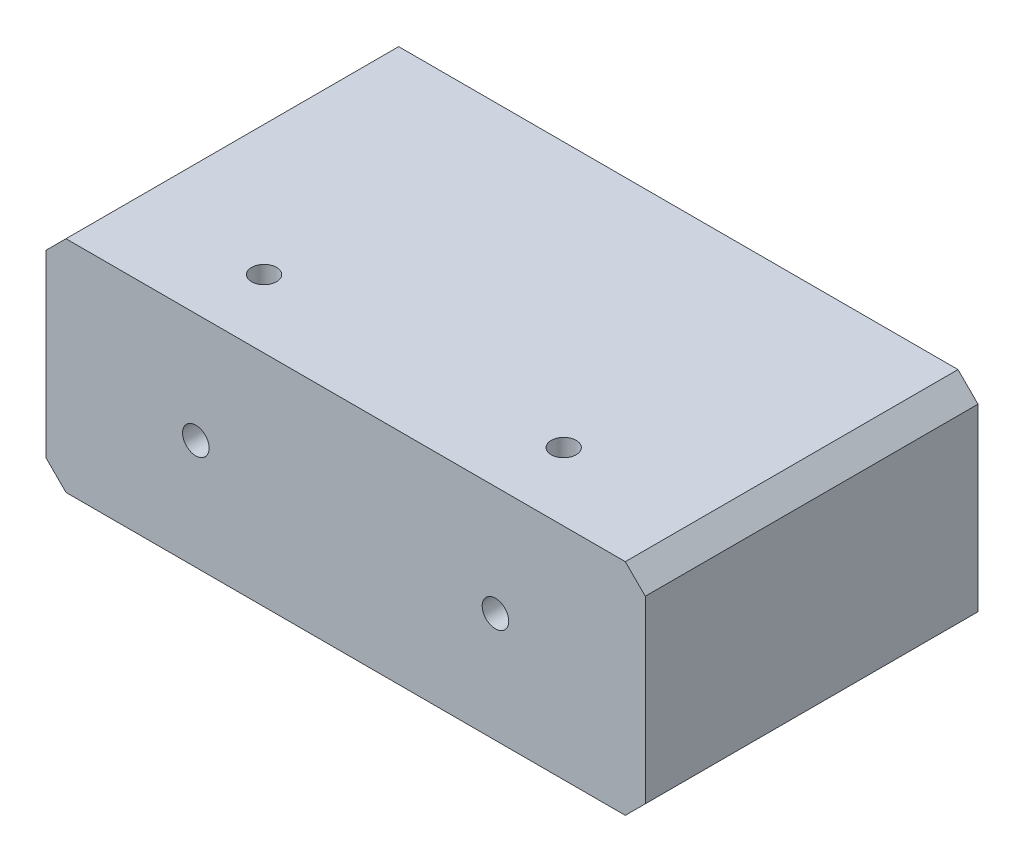
ISO-10303-21;
HEADER;
FILE_DESCRIPTION(('STEP AP214'),'2;1');
FILE_NAME('part.step','',(''),(''),'','','');
FILE_SCHEMA(('AUTOMOTIVE_DESIGN { 1 0 10303 214 1 1 1 1 }'));
ENDSEC;
DATA;
#1=APPLICATION_CONTEXT('core data for automotive mechanical design processes');
#2=APPLICATION_PROTOCOL_DEFINITION('international standard','automotive_design',2000,#1);
#3=PRODUCT_CONTEXT('',#1,'mechanical');
#4=PRODUCT('Part','Part','',(#3));
#5=PRODUCT_RELATED_PRODUCT_CATEGORY('part','',(#4));
#6=PRODUCT_DEFINITION_FORMATION('','',#4);
#7=PRODUCT_DEFINITION_CONTEXT('part definition',#1,'design');
#8=PRODUCT_DEFINITION('design','',#6,#7);
#9=PRODUCT_DEFINITION_SHAPE('','',#8);
#10=(LENGTH_UNIT() NAMED_UNIT(*) SI_UNIT(.MILLI.,.METRE.));
#11=(NAMED_UNIT(*) PLANE_ANGLE_UNIT() SI_UNIT($,.RADIAN.));
#12=(NAMED_UNIT(*) SI_UNIT($,.STERADIAN.) SOLID_ANGLE_UNIT());
#13=UNCERTAINTY_MEASURE_WITH_UNIT(LENGTH_MEASURE(1.E-05),#10,'distance_accuracy_value','');
#14=(GEOMETRIC_REPRESENTATION_CONTEXT(3) GLOBAL_UNCERTAINTY_ASSIGNED_CONTEXT((#13)) GLOBAL_UNIT_ASSIGNED_CONTEXT((#10,
#11,#12)) REPRESENTATION_CONTEXT('',''));
#15=CARTESIAN_POINT('',(0.,0.,0.));
#16=DIRECTION('',(0.,0.,1.));
#17=DIRECTION('',(1.,0.,0.));
#18=AXIS2_PLACEMENT_3D('',#15,#16,#17);
#19=CARTESIAN_POINT('',(-76.2,55.88,42.3037));
#20=DIRECTION('',(1.,0.,0.));
#21=DIRECTION('',(0.,0.,-1.));
#22=AXIS2_PLACEMENT_3D('',#19,#20,#21);
#23=PLANE('',#22);
#24=DIRECTION('',(0.,-1.,0.));
#25=VECTOR('',#24,1.);
#26=CARTESIAN_POINT('',(-76.2,55.88,-42.3037));
#27=LINE('',#26,#25);
#28=CARTESIAN_POINT('',(-76.2,50.8,-42.3037));
#29=VERTEX_POINT('',#28);
#30=CARTESIAN_POINT('',(-76.2,5.08000000000003,-42.3037));
#31=VERTEX_POINT('',#30);
#32=EDGE_CURVE('E177',#29,#31,#27,.T.);
#33=ORIENTED_EDGE('',*,*,#32,.T.);
#34=DIRECTION('',(0.,0.,1.));
#35=VECTOR('',#34,1.);
#36=CARTESIAN_POINT('',(-76.2,5.08,42.3037));
#37=LINE('',#36,#35);
#38=CARTESIAN_POINT('',(-76.2,5.08000000000002,42.3037));
#39=VERTEX_POINT('',#38);
#40=EDGE_CURVE('E13',#31,#39,#37,.T.);
#41=ORIENTED_EDGE('',*,*,#40,.T.);
#42=DIRECTION('',(0.,-1.,0.));
#43=VECTOR('',#42,1.);
#44=CARTESIAN_POINT('',(-76.2,55.88,42.3037));
#45=LINE('',#44,#43);
#46=CARTESIAN_POINT('',(-76.2,50.8,42.3037));
#47=VERTEX_POINT('',#46);
#48=EDGE_CURVE('E191',#47,#39,#45,.T.);
#49=ORIENTED_EDGE('',*,*,#48,.F.);
#50=DIRECTION('',(0.,0.,-1.));
#51=VECTOR('',#50,1.);
#52=CARTESIAN_POINT('',(-76.2,50.8,-42.3037));
#53=LINE('',#52,#51);
#54=EDGE_CURVE('E62',#47,#29,#53,.T.);
#55=ORIENTED_EDGE('',*,*,#54,.T.);
#56=EDGE_LOOP('',(#33,#41,#49,#55));
#57=FACE_BOUND('',#56,.T.);
#58=ADVANCED_FACE('F53',(#57),#23,.F.);
#59=CARTESIAN_POINT('',(76.2,55.88,42.3037));
#60=DIRECTION('',(0.,0.,-1.));
#61=DIRECTION('',(-1.,0.,0.));
#62=AXIS2_PLACEMENT_3D('',#59,#60,#61);
#63=PLANE('',#62);
#64=CARTESIAN_POINT('',(-38.1,27.94,42.3037));
#65=DIRECTION('',(0.,0.,1.));
#66=DIRECTION('',(1.,0.,0.));
#67=AXIS2_PLACEMENT_3D('',#64,#65,#66);
#68=CIRCLE('',#67,3.3782);
#69=CARTESIAN_POINT('',(-34.7218,27.94,42.3037));
#70=VERTEX_POINT('',#69);
#71=EDGE_CURVE('E228',#70,#70,#68,.T.);
#72=ORIENTED_EDGE('',*,*,#71,.F.);
#73=EDGE_LOOP('',(#72));
#74=FACE_BOUND('',#73,.T.);
#75=CARTESIAN_POINT('',(38.1,27.94,42.3037));
#76=DIRECTION('',(0.,0.,1.));
#77=DIRECTION('',(1.,0.,0.));
#78=AXIS2_PLACEMENT_3D('',#75,#76,#77);
#79=CIRCLE('',#78,3.3782);
#80=CARTESIAN_POINT('',(41.4782,27.94,42.3037));
#81=VERTEX_POINT('',#80);
#82=EDGE_CURVE('E159',#81,#81,#79,.T.);
#83=ORIENTED_EDGE('',*,*,#82,.F.);
#84=EDGE_LOOP('',(#83));
#85=FACE_BOUND('',#84,.T.);
#86=DIRECTION('',(0.,-1.,0.));
#87=VECTOR('',#86,1.);
#88=CARTESIAN_POINT('',(76.2,55.88,42.3037));
#89=LINE('',#88,#87);
#90=CARTESIAN_POINT('',(76.2,50.8,42.3037));
#91=VERTEX_POINT('',#90);
#92=CARTESIAN_POINT('',(76.2,5.08000000000002,42.3037));
#93=VERTEX_POINT('',#92);
#94=EDGE_CURVE('E188',#91,#93,#89,.T.);
#95=ORIENTED_EDGE('',*,*,#94,.F.);
#96=DIRECTION('',(-0.707106781186548,0.707106781186548,0.));
#97=VECTOR('',#96,1.);
#98=CARTESIAN_POINT('',(71.12,55.88,42.3037));
#99=LINE('',#98,#97);
#100=CARTESIAN_POINT('',(71.12,55.88,42.3037));
#101=VERTEX_POINT('',#100);
#102=EDGE_CURVE('E249',#91,#101,#99,.T.);
#103=ORIENTED_EDGE('',*,*,#102,.T.);
#104=DIRECTION('',(1.,0.,0.));
#105=VECTOR('',#104,1.);
#106=CARTESIAN_POINT('',(76.2,55.88,42.3037));
#107=LINE('',#106,#105);
#108=CARTESIAN_POINT('',(-71.12,55.88,42.3037));
#109=VERTEX_POINT('',#108);
#110=EDGE_CURVE('E170',#109,#101,#107,.T.);
#111=ORIENTED_EDGE('',*,*,#110,.F.);
#112=DIRECTION('',(-0.707106781186548,-0.707106781186548,0.));
#113=VECTOR('',#112,1.);
#114=CARTESIAN_POINT('',(-71.12,55.88,42.3037));
#115=LINE('',#114,#113);
#116=EDGE_CURVE('E76',#109,#47,#115,.T.);
#117=ORIENTED_EDGE('',*,*,#116,.T.);
#118=ORIENTED_EDGE('',*,*,#48,.T.);
#119=DIRECTION('',(-0.70710678118655,0.707106781186546,0.));
#120=VECTOR('',#119,1.);
#121=CARTESIAN_POINT('',(-76.2,5.08,42.3037));
#122=LINE('',#121,#120);
#123=CARTESIAN_POINT('',(-71.1199999999999,0.,42.3037));
#124=VERTEX_POINT('',#123);
#125=EDGE_CURVE('E69',#39,#124,#122,.F.);
#126=ORIENTED_EDGE('',*,*,#125,.T.);
#127=DIRECTION('',(1.,0.,0.));
#128=VECTOR('',#127,1.);
#129=CARTESIAN_POINT('',(76.2,0.,42.3037));
#130=LINE('',#129,#128);
#131=CARTESIAN_POINT('',(71.12,0.,42.3037));
#132=VERTEX_POINT('',#131);
#133=EDGE_CURVE('E158',#124,#132,#130,.T.);
#134=ORIENTED_EDGE('',*,*,#133,.T.);
#135=DIRECTION('',(-0.70710678118655,-0.707106781186546,0.));
#136=VECTOR('',#135,1.);
#137=CARTESIAN_POINT('',(76.2,5.08,42.3037));
#138=LINE('',#137,#136);
#139=EDGE_CURVE('E251',#132,#93,#138,.F.);
#140=ORIENTED_EDGE('',*,*,#139,.T.);
#141=EDGE_LOOP('',(#95,#103,#111,#117,#118,#126,#134,#140));
#142=FACE_BOUND('',#141,.T.);
#143=ADVANCED_FACE('F241',(#74,#85,#142),#63,.F.);
#144=CARTESIAN_POINT('',(76.2,55.88,42.3037));
#145=DIRECTION('',(-1.,0.,0.));
#146=DIRECTION('',(0.,0.,1.));
#147=AXIS2_PLACEMENT_3D('',#144,#145,#146);
#148=PLANE('',#147);
#149=DIRECTION('',(0.,-1.,0.));
#150=VECTOR('',#149,1.);
#151=CARTESIAN_POINT('',(76.2,55.88,-42.3037));
#152=LINE('',#151,#150);
#153=CARTESIAN_POINT('',(76.2,50.8,-42.3037));
#154=VERTEX_POINT('',#153);
#155=CARTESIAN_POINT('',(76.2,5.08000000000002,-42.3037));
#156=VERTEX_POINT('',#155);
#157=EDGE_CURVE('E184',#154,#156,#152,.T.);
#158=ORIENTED_EDGE('',*,*,#157,.F.);
#159=DIRECTION('',(0.,0.,1.));
#160=VECTOR('',#159,1.);
#161=CARTESIAN_POINT('',(76.2,50.8,42.3037));
#162=LINE('',#161,#160);
#163=EDGE_CURVE('E259',#154,#91,#162,.T.);
#164=ORIENTED_EDGE('',*,*,#163,.T.);
#165=ORIENTED_EDGE('',*,*,#94,.T.);
#166=DIRECTION('',(0.,0.,-1.));
#167=VECTOR('',#166,1.);
#168=CARTESIAN_POINT('',(76.2,5.08,42.3037));
#169=LINE('',#168,#167);
#170=EDGE_CURVE('E294',#93,#156,#169,.T.);
#171=ORIENTED_EDGE('',*,*,#170,.T.);
#172=EDGE_LOOP('',(#158,#164,#165,#171));
#173=FACE_BOUND('',#172,.T.);
#174=ADVANCED_FACE('F244',(#173),#148,.F.);
#175=CARTESIAN_POINT('',(76.2,55.88,-42.3037));
#176=DIRECTION('',(0.,0.,1.));
#177=DIRECTION('',(1.,0.,0.));
#178=AXIS2_PLACEMENT_3D('',#175,#176,#177);
#179=PLANE('',#178);
#180=DIRECTION('',(-1.,0.,0.));
#181=VECTOR('',#180,1.);
#182=CARTESIAN_POINT('',(76.2,55.88,-42.3037));
#183=LINE('',#182,#181);
#184=CARTESIAN_POINT('',(71.12,55.88,-42.3037));
#185=VERTEX_POINT('',#184);
#186=CARTESIAN_POINT('',(-71.12,55.88,-42.3037));
#187=VERTEX_POINT('',#186);
#188=EDGE_CURVE('E174',#185,#187,#183,.T.);
#189=ORIENTED_EDGE('',*,*,#188,.F.);
#190=DIRECTION('',(0.707106781186548,-0.707106781186548,0.));
#191=VECTOR('',#190,1.);
#192=CARTESIAN_POINT('',(71.12,55.88,-42.3037));
#193=LINE('',#192,#191);
#194=EDGE_CURVE('E292',#185,#154,#193,.T.);
#195=ORIENTED_EDGE('',*,*,#194,.T.);
#196=ORIENTED_EDGE('',*,*,#157,.T.);
#197=DIRECTION('',(0.70710678118655,0.707106781186546,0.));
#198=VECTOR('',#197,1.);
#199=CARTESIAN_POINT('',(76.2,5.08,-42.3037));
#200=LINE('',#199,#198);
#201=CARTESIAN_POINT('',(71.12,0.,-42.3037));
#202=VERTEX_POINT('',#201);
#203=EDGE_CURVE('E286',#156,#202,#200,.F.);
#204=ORIENTED_EDGE('',*,*,#203,.T.);
#205=DIRECTION('',(-1.,0.,0.));
#206=VECTOR('',#205,1.);
#207=CARTESIAN_POINT('',(76.2,0.,-42.3037));
#208=LINE('',#207,#206);
#209=CARTESIAN_POINT('',(-71.1199999999999,0.,-42.3037));
#210=VERTEX_POINT('',#209);
#211=EDGE_CURVE('E163',#202,#210,#208,.T.);
#212=ORIENTED_EDGE('',*,*,#211,.T.);
#213=DIRECTION('',(0.70710678118655,-0.707106781186546,0.));
#214=VECTOR('',#213,1.);
#215=CARTESIAN_POINT('',(-76.2,5.08,-42.3037));
#216=LINE('',#215,#214);
#217=EDGE_CURVE('E282',#210,#31,#216,.F.);
#218=ORIENTED_EDGE('',*,*,#217,.T.);
#219=ORIENTED_EDGE('',*,*,#32,.F.);
#220=DIRECTION('',(0.707106781186548,0.707106781186548,0.));
#221=VECTOR('',#220,1.);
#222=CARTESIAN_POINT('',(-71.12,55.88,-42.3037));
#223=LINE('',#222,#221);
#224=EDGE_CURVE('E280',#29,#187,#223,.T.);
#225=ORIENTED_EDGE('',*,*,#224,.T.);
#226=EDGE_LOOP('',(#189,#195,#196,#204,#212,#218,#219,#225));
#227=FACE_BOUND('',#226,.T.);
#228=ADVANCED_FACE('F279',(#227),#179,.F.);
#229=CARTESIAN_POINT('',(-76.2,55.88,-42.3037));
#230=DIRECTION('',(0.,1.,0.));
#231=DIRECTION('',(0.,0.,1.));
#232=AXIS2_PLACEMENT_3D('',#229,#230,#231);
#233=PLANE('',#232);
#234=CARTESIAN_POINT('',(38.1609879394625,55.88,25.0113757542834));
#235=DIRECTION('',(0.,1.,0.));
#236=DIRECTION('',(0.,0.,1.));
#237=AXIS2_PLACEMENT_3D('',#234,#235,#236);
#238=CIRCLE('',#237,3.175);
#239=CARTESIAN_POINT('',(38.1609879394625,55.88,28.1863757542834));
#240=VERTEX_POINT('',#239);
#241=EDGE_CURVE('E155',#240,#240,#238,.T.);
#242=ORIENTED_EDGE('',*,*,#241,.F.);
#243=EDGE_LOOP('',(#242));
#244=FACE_BOUND('',#243,.T.);
#245=CARTESIAN_POINT('',(-38.0390120605375,55.88,25.0113757542834));
#246=DIRECTION('',(0.,1.,0.));
#247=DIRECTION('',(0.,0.,1.));
#248=AXIS2_PLACEMENT_3D('',#245,#246,#247);
#249=CIRCLE('',#248,3.175);
#250=CARTESIAN_POINT('',(-38.0390120605375,55.88,28.1863757542834));
#251=VERTEX_POINT('',#250);
#252=EDGE_CURVE('E154',#251,#251,#249,.T.);
#253=ORIENTED_EDGE('',*,*,#252,.F.);
#254=EDGE_LOOP('',(#253));
#255=FACE_BOUND('',#254,.T.);
#256=ORIENTED_EDGE('',*,*,#110,.T.);
#257=DIRECTION('',(0.,0.,-1.));
#258=VECTOR('',#257,1.);
#259=CARTESIAN_POINT('',(71.12,55.88,-42.3037));
#260=LINE('',#259,#258);
#261=EDGE_CURVE('E261',#101,#185,#260,.T.);
#262=ORIENTED_EDGE('',*,*,#261,.T.);
#263=ORIENTED_EDGE('',*,*,#188,.T.);
#264=DIRECTION('',(0.,0.,1.));
#265=VECTOR('',#264,1.);
#266=CARTESIAN_POINT('',(-71.12,55.88,42.3037));
#267=LINE('',#266,#265);
#268=EDGE_CURVE('E147',#187,#109,#267,.T.);
#269=ORIENTED_EDGE('',*,*,#268,.T.);
#270=EDGE_LOOP('',(#256,#262,#263,#269));
#271=FACE_BOUND('',#270,.T.);
#272=ADVANCED_FACE('F338',(#244,#255,#271),#233,.T.);
#273=CARTESIAN_POINT('',(-76.2,0.,-42.3037));
#274=DIRECTION('',(0.,1.,0.));
#275=DIRECTION('',(0.,0.,1.));
#276=AXIS2_PLACEMENT_3D('',#273,#274,#275);
#277=PLANE('',#276);
#278=ORIENTED_EDGE('',*,*,#211,.F.);
#279=DIRECTION('',(0.,0.,1.));
#280=VECTOR('',#279,1.);
#281=CARTESIAN_POINT('',(71.12,0.,-42.3037));
#282=LINE('',#281,#280);
#283=EDGE_CURVE('E265',#202,#132,#282,.T.);
#284=ORIENTED_EDGE('',*,*,#283,.T.);
#285=ORIENTED_EDGE('',*,*,#133,.F.);
#286=DIRECTION('',(0.,0.,-1.));
#287=VECTOR('',#286,1.);
#288=CARTESIAN_POINT('',(-71.12,0.,-42.3037));
#289=LINE('',#288,#287);
#290=EDGE_CURVE('E262',#124,#210,#289,.T.);
#291=ORIENTED_EDGE('',*,*,#290,.T.);
#292=EDGE_LOOP('',(#278,#284,#285,#291));
#293=FACE_BOUND('',#292,.T.);
#294=ADVANCED_FACE('F301',(#293),#277,.F.);
#295=CARTESIAN_POINT('',(38.1,27.94,22.6187));
#296=DIRECTION('',(0.,0.,1.));
#297=DIRECTION('',(1.,0.,0.));
#298=AXIS2_PLACEMENT_3D('',#295,#296,#297);
#299=CONICAL_SURFACE('',#298,3.3782,1.02974425867665);
#300=CARTESIAN_POINT('',(38.1,27.94,20.5888726568011));
#301=VERTEX_POINT('',#300);
#302=VERTEX_LOOP('',#301);
#303=FACE_BOUND('',#302,.T.);
#304=CARTESIAN_POINT('',(38.1,27.94,22.6187));
#305=DIRECTION('',(0.,0.,1.));
#306=DIRECTION('',(1.,0.,0.));
#307=AXIS2_PLACEMENT_3D('',#304,#305,#306);
#308=CIRCLE('',#307,3.3782);
#309=CARTESIAN_POINT('',(36.0739499103734,30.643212214075,22.6187));
#310=VERTEX_POINT('',#309);
#311=CARTESIAN_POINT('',(40.2480259685582,30.5473395786556,22.6187000000021));
#312=VERTEX_POINT('',#311);
#313=EDGE_CURVE('E153',#310,#312,#308,.T.);
#314=ORIENTED_EDGE('',*,*,#313,.T.);
#315=CARTESIAN_POINT('',(40.3346720956556,30.6450787831859,22.6971324245716));
#316=CARTESIAN_POINT('',(40.3013066473125,30.6049925230924,22.6658018697946));
#317=CARTESIAN_POINT('',(40.2664814513919,30.566078264982,22.6344420724946));
#318=CARTESIAN_POINT('',(40.1936111964662,30.4910986926359,22.5718283880616));
#319=CARTESIAN_POINT('',(40.1555596871618,30.4550393782958,22.5405748495242));
#320=CARTESIAN_POINT('',(40.076231189395,30.3865816624109,22.4785932668131));
#321=CARTESIAN_POINT('',(40.0349677944103,30.3541691151574,22.4478636142808));
#322=CARTESIAN_POINT('',(39.9490129426231,30.2934715636725,22.3871889416369));
#323=CARTESIAN_POINT('',(39.9043238904874,30.2651837038397,22.3572433905737));
#324=CARTESIAN_POINT('',(39.8109690108395,30.2128844036409,22.298208981981));
#325=CARTESIAN_POINT('',(39.7622593908204,30.1889327103254,22.2691361179969));
#326=CARTESIAN_POINT('',(39.6616692279098,30.1460373216859,22.2128221980724));
#327=CARTESIAN_POINT('',(39.6097883287236,30.127094190354,22.1855813486843));
#328=CARTESIAN_POINT('',(39.5034245892999,30.0941451302213,22.1335313387768));
#329=CARTESIAN_POINT('',(39.4489458027008,30.0801317780913,22.1087185630569));
#330=CARTESIAN_POINT('',(39.3378506159983,30.0565156075215,22.061925657564));
#331=CARTESIAN_POINT('',(39.281233374416,30.0469145452968,22.0399466582132));
#332=CARTESIAN_POINT('',(39.1537095686253,30.0296648703048,21.9946456821591));
#333=CARTESIAN_POINT('',(39.0824080007306,30.0229153422979,21.972098584417));
#334=CARTESIAN_POINT('',(38.9381493275763,30.0133361433753,21.9320484210767));
#335=CARTESIAN_POINT('',(38.8651916135913,30.0105079382737,21.9145472436091));
#336=CARTESIAN_POINT('',(38.7179213838003,30.0073617981699,21.8846977580857));
#337=CARTESIAN_POINT('',(38.6436050127767,30.0070527051854,21.8723677441397));
#338=CARTESIAN_POINT('',(38.4943094767048,30.0079049868339,21.8530236680375));
#339=CARTESIAN_POINT('',(38.4193304075941,30.0090661519737,21.8460088487612));
#340=CARTESIAN_POINT('',(38.2659123215812,30.0122976479332,21.8371411586386));
#341=CARTESIAN_POINT('',(38.1874607107276,30.0144042465878,21.8355183936483));
#342=CARTESIAN_POINT('',(38.030668809611,30.0193571073965,21.8380823107435));
#343=CARTESIAN_POINT('',(37.9523285330119,30.0222034535804,21.8422696530496));
#344=CARTESIAN_POINT('',(37.7962759280127,30.029000954911,21.8564210376722));
#345=CARTESIAN_POINT('',(37.7185631411239,30.0329512105266,21.8663803836834));
#346=CARTESIAN_POINT('',(37.5642322941765,30.0428311649616,21.8919793744737));
#347=CARTESIAN_POINT('',(37.4876140354905,30.0487604997478,21.9076179746536));
#348=CARTESIAN_POINT('',(37.2902594270632,30.0684453959095,21.9555538126877));
#349=CARTESIAN_POINT('',(37.170761523818,30.084763967638,21.9922106665696));
#350=CARTESIAN_POINT('',(36.939716387565,30.132118258397,22.0780810809515));
#351=CARTESIAN_POINT('',(36.8281420751952,30.1631007724038,22.1272489520326));
#352=CARTESIAN_POINT('',(36.6160381835048,30.2440633282463,22.2350438112098));
#353=CARTESIAN_POINT('',(36.5155813153918,30.2941598813305,22.2937275166151));
#354=CARTESIAN_POINT('',(36.3287114742761,30.4120741123363,22.4160002814543));
#355=CARTESIAN_POINT('',(36.2423436190717,30.4799469756525,22.4796041742227));
#356=CARTESIAN_POINT('',(36.13151621133,30.5836959025323,22.5693469431898));
#357=CARTESIAN_POINT('',(36.1011871907853,30.6141195238186,22.5948972662171));
#358=CARTESIAN_POINT('',(36.0427074802293,30.6765751500393,22.6459992116997));
#359=CARTESIAN_POINT('',(36.0145458240563,30.7085974907611,22.6715500689052));
#360=CARTESIAN_POINT('',(35.9873037832695,30.7413791771477,22.6971324245716));
#361=B_SPLINE_CURVE_WITH_KNOTS('',3,(#315,#316,#317,#318,#319,#320,#321,#322,#323,#324,#325,
#326,#327,#328,#329,#330,#331,#332,#333,#334,#335,#336,#337,#338,#339,#340,#341,#342,#343,#344,
#345,#346,#347,#348,#349,#350,#351,#352,#353,#354,#355,#356,#357,#358,#359,#360),.UNSPECIFIED.,
.F.,.F.,(4,2,2,2,2,2,2,2,2,2,2,2,2,2,2,2,2,2,2,2,2,2,4),(0.,0.182563023234737,0.365500059357615,
0.54770106056855,0.729775315371295,0.91419373964892,1.09863292164195,1.28279317166469,
1.46702665928004,1.69193612770197,1.9169296459972,2.14271254703751,2.36846328050236,
2.6037320380497,2.83902753211121,3.07413184971291,3.30919294588203,3.68591096432339,
4.06127249812161,4.43895961060757,4.81783341994081,4.96773562438841,5.11682125866778),.UNSPECIFIED.);
#362=EDGE_CURVE('E140',#312,#310,#361,.T.);
#363=ORIENTED_EDGE('',*,*,#362,.T.);
#364=EDGE_LOOP('',(#314,#363));
#365=FACE_BOUND('',#364,.T.);
#366=ADVANCED_FACE('F157',(#303,#365),#299,.F.);
#367=CARTESIAN_POINT('',(38.1,27.94,42.3037));
#368=DIRECTION('',(0.,0.,1.));
#369=DIRECTION('',(1.,0.,0.));
#370=AXIS2_PLACEMENT_3D('',#367,#368,#369);
#371=CYLINDRICAL_SURFACE('',#370,3.3782);
#372=ORIENTED_EDGE('',*,*,#313,.F.);
#373=CARTESIAN_POINT('',(36.0739499103734,30.643212214075,22.6187));
#374=CARTESIAN_POINT('',(36.0295866160006,30.6099608740223,22.6574002196383));
#375=CARTESIAN_POINT('',(35.9865982582737,30.5760365785824,22.6970657661524));
#376=CARTESIAN_POINT('',(35.903340514554,30.5070695301081,22.7782087398588));
#377=CARTESIAN_POINT('',(35.8630704166102,30.4720270735049,22.8196856878952));
#378=CARTESIAN_POINT('',(35.7462642100333,30.3655429228362,22.9466793786042));
#379=CARTESIAN_POINT('',(35.6737243326839,30.292738470895,23.0347658725675));
#380=CARTESIAN_POINT('',(35.5386781657734,30.1449816270779,23.2177388996611));
#381=CARTESIAN_POINT('',(35.4762346003162,30.0700189789125,23.3126630151038));
#382=CARTESIAN_POINT('',(35.3617014743542,29.9206028052672,23.5088688169721));
#383=CARTESIAN_POINT('',(35.3096058472403,29.8461490063393,23.6101467322991));
#384=CARTESIAN_POINT('',(35.2219912242687,29.7105722944276,23.8060277739827));
#385=CARTESIAN_POINT('',(35.1851905525697,29.6489898827393,23.8997381503507));
#386=CARTESIAN_POINT('',(35.1197495930877,29.5321024120834,24.0937817363038));
#387=CARTESIAN_POINT('',(35.0911021450769,29.4767918709523,24.1941090388637));
#388=CARTESIAN_POINT('',(35.0491048144675,29.3911891353063,24.376408613679));
#389=CARTESIAN_POINT('',(35.0337174183684,29.3581113257967,24.4565636939514));
#390=CARTESIAN_POINT('',(35.008928692074,29.30324336793,24.621456099087));
#391=CARTESIAN_POINT('',(34.9995056615779,29.2814123546763,24.7061755814773));
#392=CARTESIAN_POINT('',(34.9886341159077,29.2559803704953,24.8635227171729));
#393=CARTESIAN_POINT('',(34.9860715716768,29.2498417108822,24.9356450856478));
#394=CARTESIAN_POINT('',(34.9859083736731,29.2494534536511,25.0799200775633));
#395=CARTESIAN_POINT('',(34.9883070927409,29.2552023533119,25.1520726960271));
#396=CARTESIAN_POINT('',(34.9990158871875,29.2802807319521,25.3122663958513));
#397=CARTESIAN_POINT('',(35.0086659460201,29.3026734589089,25.3997178247471));
#398=CARTESIAN_POINT('',(35.0342908569245,29.3593689227661,25.5698282807134));
#399=CARTESIAN_POINT('',(35.0502936032871,29.393724103261,25.6524643033539));
#400=CARTESIAN_POINT('',(35.0870012558803,29.4683136800872,25.8098117855535));
#401=CARTESIAN_POINT('',(35.1075040092783,29.5082745368495,25.8847051525558));
#402=CARTESIAN_POINT('',(35.1530935590494,29.5923526880859,26.0307145735942));
#403=CARTESIAN_POINT('',(35.1781848653071,29.636474050888,26.1018268217923));
#404=CARTESIAN_POINT('',(35.2327479525214,29.7271508045996,26.2408535500168));
#405=CARTESIAN_POINT('',(35.2622250700984,29.7737091153953,26.3087639996686));
#406=CARTESIAN_POINT('',(35.3254616840598,29.8680565609522,26.4417023470574));
#407=CARTESIAN_POINT('',(35.3592227778696,29.9158461495121,26.5067291572632));
#408=CARTESIAN_POINT('',(35.4363513461144,30.0189288806477,26.6435615604857));
#409=CARTESIAN_POINT('',(35.4804008493514,30.0742822641424,26.7149394988456));
#410=CARTESIAN_POINT('',(35.5741966542321,30.184504567927,26.854250371287));
#411=CARTESIAN_POINT('',(35.6239447121307,30.2393733332188,26.9221822339546));
#412=CARTESIAN_POINT('',(35.7817668681778,30.4018637757882,27.1205158572516));
#413=CARTESIAN_POINT('',(35.8985842356098,30.5075986055754,27.2457506477218));
#414=CARTESIAN_POINT('',(36.1407293669128,30.6957463559781,27.4654703479812));
#415=CARTESIAN_POINT('',(36.2633475158694,30.7794349729209,27.5618419764114));
#416=CARTESIAN_POINT('',(36.5272569991515,30.9336571358102,27.7384010242996));
#417=CARTESIAN_POINT('',(36.6685289966238,31.004204124438,27.8186049887727));
#418=CARTESIAN_POINT('',(36.9405208379184,31.1157326921422,27.9455285107727));
#419=CARTESIAN_POINT('',(37.0683643155048,31.1597688581131,27.9956971053919));
#420=CARTESIAN_POINT('',(37.3333781569076,31.2329272727311,28.0797565872558));
#421=CARTESIAN_POINT('',(37.4705415693419,31.2620605015413,28.1136594575885));
#422=CARTESIAN_POINT('',(37.7515422254146,31.3031935161703,28.163109786928));
#423=CARTESIAN_POINT('',(37.8954130798128,31.3150946047147,28.17855142189));
#424=CARTESIAN_POINT('',(38.1842458850119,31.3202335889862,28.1895749787798));
#425=CARTESIAN_POINT('',(38.3292075847092,31.3134756562606,28.185161339559));
#426=CARTESIAN_POINT('',(38.6018865014211,31.2832654225743,28.1583213928837));
#427=CARTESIAN_POINT('',(38.7299595816312,31.2614131509575,28.1375968994363));
#428=CARTESIAN_POINT('',(38.9797053873123,31.2041659918619,28.0816712914029));
#429=CARTESIAN_POINT('',(39.1013769865822,31.1687687304391,28.0464676390659));
#430=CARTESIAN_POINT('',(39.3435897377302,31.0837604885457,27.9608869029185));
#431=CARTESIAN_POINT('',(39.4635696714049,31.0333903569652,27.9096890153889));
#432=CARTESIAN_POINT('',(39.6924300276278,30.9220525718827,27.795562737567));
#433=CARTESIAN_POINT('',(39.8013042490798,30.8610790486013,27.7326278485517));
#434=CARTESIAN_POINT('',(40.0652710605585,30.6942889451655,27.5591923059986));
#435=CARTESIAN_POINT('',(40.2121149537266,30.5824778433772,27.4417875820704));
#436=CARTESIAN_POINT('',(40.4114339700228,30.4052542978502,27.252926694762));
#437=CARTESIAN_POINT('',(40.4744769094313,30.3444773883884,27.1877186100775));
#438=CARTESIAN_POINT('',(40.5937796475923,30.2205006330684,27.0534828186325));
#439=CARTESIAN_POINT('',(40.6500406525973,30.1573012207262,26.9844557943144));
#440=CARTESIAN_POINT('',(40.7573685872204,30.0275605882317,26.841041243483));
#441=CARTESIAN_POINT('',(40.8082548691307,29.9609752067522,26.7665594248804));
#442=CARTESIAN_POINT('',(40.9032671382886,29.8269738869623,26.6140623211582));
#443=CARTESIAN_POINT('',(40.9473909172066,29.7595576850752,26.5360458925236));
#444=CARTESIAN_POINT('',(41.02892134819,29.625175914208,26.3765118450184));
#445=CARTESIAN_POINT('',(41.0663409119483,29.5582097233872,26.2950013391242));
#446=CARTESIAN_POINT('',(41.1346024028088,29.4262419721938,26.1278005588107));
#447=CARTESIAN_POINT('',(41.1654491833471,29.3612389928132,26.0421134263252));
#448=CARTESIAN_POINT('',(41.2150269198173,29.2483824871857,25.8825863934815));
#449=CARTESIAN_POINT('',(41.2349475706382,29.1996698703327,25.8097293344057));
#450=CARTESIAN_POINT('',(41.2701634862208,29.1081924710367,25.6591685579978));
#451=CARTESIAN_POINT('',(41.2854611850504,29.0654245650246,25.5814674172512));
#452=CARTESIAN_POINT('',(41.3068232559628,29.0026727547343,25.4444617942795));
#453=CARTESIAN_POINT('',(41.3142807096397,28.9797186963427,25.3867787033935));
#454=CARTESIAN_POINT('',(41.326116942121,28.9423927159728,25.2684650341645));
#455=CARTESIAN_POINT('',(41.3305065125605,28.9279907382249,25.2078455979061));
#456=CARTESIAN_POINT('',(41.335773821586,28.9106210552466,25.0837944688396));
#457=CARTESIAN_POINT('',(41.336599044505,28.9078243609474,25.0203345511996));
#458=CARTESIAN_POINT('',(41.3344547412202,28.9149581399996,24.8942052977115));
#459=CARTESIAN_POINT('',(41.3314814789235,28.9249011438208,24.8315368015452));
#460=CARTESIAN_POINT('',(41.3210921031123,28.9584058538867,24.6949851799318));
#461=CARTESIAN_POINT('',(41.3128090272852,28.9845809119533,24.6218516022592));
#462=CARTESIAN_POINT('',(41.29205666629,29.046380837567,24.480141547136));
#463=CARTESIAN_POINT('',(41.2795638440974,29.0820585950269,24.4115933484892));
#464=CARTESIAN_POINT('',(41.2449875453838,29.1747609311471,24.2505041606405));
#465=CARTESIAN_POINT('',(41.2210786920539,29.2344676191616,24.1599390490359));
#466=CARTESIAN_POINT('',(41.1666342695161,29.3586762139591,23.9841603957665));
#467=CARTESIAN_POINT('',(41.1360859794683,29.4231871673187,23.898957537722));
#468=CARTESIAN_POINT('',(41.0684593038073,29.554291958056,23.7325856577656));
#469=CARTESIAN_POINT('',(41.0313690623495,29.6208893933934,23.651424308576));
#470=CARTESIAN_POINT('',(40.9506844666777,29.7543642377178,23.492782252102));
#471=CARTESIAN_POINT('',(40.9070955997665,29.8212413646744,23.4152985115997));
#472=CARTESIAN_POINT('',(40.8193984286362,29.945520449862,23.2737132058094));
#473=CARTESIAN_POINT('',(40.7761058869853,30.0030161872416,23.2091880931308));
#474=CARTESIAN_POINT('',(40.684362844254,30.1168434440899,23.0828274008666));
#475=CARTESIAN_POINT('',(40.635912455135,30.173174988798,23.0209917629416));
#476=CARTESIAN_POINT('',(40.5340123500821,30.283809669641,22.9005536576288));
#477=CARTESIAN_POINT('',(40.4805928630524,30.3381225770359,22.8419346980557));
#478=CARTESIAN_POINT('',(40.3683728331208,30.4445357769401,22.7278556399163));
#479=CARTESIAN_POINT('',(40.3095696713387,30.4966349743583,22.6723971002417));
#480=CARTESIAN_POINT('',(40.2480259685517,30.5473395786563,22.6187));
#481=B_SPLINE_CURVE_WITH_KNOTS('',3,(#373,#374,#375,#376,#377,#378,#379,#380,#381,#382,#383,
#384,#385,#386,#387,#388,#389,#390,#391,#392,#393,#394,#395,#396,#397,#398,#399,#400,#401,#402,
#403,#404,#405,#406,#407,#408,#409,#410,#411,#412,#413,#414,#415,#416,#417,#418,#419,#420,#421,
#422,#423,#424,#425,#426,#427,#428,#429,#430,#431,#432,#433,#434,#435,#436,#437,#438,#439,#440,
#441,#442,#443,#444,#445,#446,#447,#448,#449,#450,#451,#452,#453,#454,#455,#456,#457,#458,#459,
#460,#461,#462,#463,#464,#465,#466,#467,#468,#469,#470,#471,#472,#473,#474,#475,#476,#477,#478,
#479,#480),.UNSPECIFIED.,.F.,.F.,(4,2,2,2,2,2,2,2,2,2,2,2,2,2,2,2,2,2,2,2,2,2,2,2,2,2,2,2,2,2,2,
2,2,2,2,2,2,2,2,2,2,2,2,2,2,2,2,2,2,2,2,2,2,4),(0.,0.202781245122417,0.405509171200053,
0.810929045691778,1.2187781354405,1.62638740818864,1.98000666740829,2.33331441021151,
2.59680994878198,2.85934120928945,3.07553142636756,3.29169431624305,3.56245210250533,
3.834412159497,4.09602106612688,4.35788849208695,4.62007720231585,4.88236396735618,
5.1836069376406,5.48494299997019,6.08639941369643,6.61557912321413,7.14421452176767,
7.57513502653216,8.00573757940437,8.43879678843524,8.8717591874243,9.26472135962761,
9.6577524353762,10.0757131088662,10.4939058960433,11.1462205064535,11.4735573163089,
11.8008358190173,12.1369267131193,12.4731271266192,12.808672921362,13.143970079057,
13.4133468059681,13.6825814530538,13.8696603380393,14.0560777934802,14.2452326770611,
14.4345737518716,14.6676106700849,14.9019727521032,15.2344937647087,15.5676575777522,
15.9014314996302,16.2349251694845,16.5247398914096,16.8145483236071,17.1026965711647,
17.3909857403882),.UNSPECIFIED.);
#482=EDGE_CURVE('E143',#310,#312,#481,.T.);
#483=ORIENTED_EDGE('',*,*,#482,.T.);
#484=EDGE_LOOP('',(#372,#483));
#485=FACE_BOUND('',#484,.T.);
#486=ORIENTED_EDGE('',*,*,#82,.T.);
#487=EDGE_LOOP('',(#486));
#488=FACE_BOUND('',#487,.T.);
#489=ADVANCED_FACE('F151',(#485,#488),#371,.F.);
#490=CARTESIAN_POINT('',(-38.1,27.94,22.6187));
#491=DIRECTION('',(0.,0.,1.));
#492=DIRECTION('',(1.,0.,0.));
#493=AXIS2_PLACEMENT_3D('',#490,#491,#492);
#494=CONICAL_SURFACE('',#493,3.3782,1.02974425867665);
#495=CARTESIAN_POINT('',(-38.1,27.94,20.5888726568011));
#496=VERTEX_POINT('',#495);
#497=VERTEX_LOOP('',#496);
#498=FACE_BOUND('',#497,.T.);
#499=CARTESIAN_POINT('',(-38.1,27.94,22.6187));
#500=DIRECTION('',(0.,0.,1.));
#501=DIRECTION('',(1.,0.,0.));
#502=AXIS2_PLACEMENT_3D('',#499,#500,#501);
#503=CIRCLE('',#502,3.3782);
#504=CARTESIAN_POINT('',(-40.1260500896266,30.643212214075,22.6187));
#505=VERTEX_POINT('',#504);
#506=CARTESIAN_POINT('',(-35.9519740314418,30.5473395786556,22.6187000000021));
#507=VERTEX_POINT('',#506);
#508=EDGE_CURVE('E166',#505,#507,#503,.T.);
#509=ORIENTED_EDGE('',*,*,#508,.T.);
#510=CARTESIAN_POINT('',(-35.8653279043444,30.6450787831859,22.6971324245716));
#511=CARTESIAN_POINT('',(-35.8986933526875,30.6049925230924,22.6658018697946));
#512=CARTESIAN_POINT('',(-35.9335185486081,30.566078264982,22.6344420724946));
#513=CARTESIAN_POINT('',(-36.0063888035338,30.4910986926359,22.5718283880616));
#514=CARTESIAN_POINT('',(-36.0444403128382,30.4550393782958,22.5405748495242));
#515=CARTESIAN_POINT('',(-36.123768810605,30.3865816624109,22.4785932668131));
#516=CARTESIAN_POINT('',(-36.1650322055897,30.3541691151574,22.4478636142808));
#517=CARTESIAN_POINT('',(-36.2509870573769,30.2934715636725,22.3871889416369));
#518=CARTESIAN_POINT('',(-36.2956761095126,30.2651837038397,22.3572433905737));
#519=CARTESIAN_POINT('',(-36.3890309891605,30.2128844036409,22.298208981981));
#520=CARTESIAN_POINT('',(-36.4377406091796,30.1889327103254,22.2691361179969));
#521=CARTESIAN_POINT('',(-36.5383307720902,30.1460373216859,22.2128221980724));
#522=CARTESIAN_POINT('',(-36.5902116712764,30.127094190354,22.1855813486843));
#523=CARTESIAN_POINT('',(-36.6965754107001,30.0941451302213,22.1335313387768));
#524=CARTESIAN_POINT('',(-36.7510541972992,30.0801317780913,22.1087185630569));
#525=CARTESIAN_POINT('',(-36.8621493840017,30.0565156075215,22.061925657564));
#526=CARTESIAN_POINT('',(-36.918766625584,30.0469145452968,22.0399466582132));
#527=CARTESIAN_POINT('',(-37.0462904313747,30.0296648703048,21.9946456821591));
#528=CARTESIAN_POINT('',(-37.1175919992694,30.0229153422979,21.972098584417));
#529=CARTESIAN_POINT('',(-37.2618506724237,30.0133361433753,21.9320484210767));
#530=CARTESIAN_POINT('',(-37.3348083864087,30.0105079382737,21.9145472436091));
#531=CARTESIAN_POINT('',(-37.4820786161997,30.0073617981699,21.8846977580857));
#532=CARTESIAN_POINT('',(-37.5563949872233,30.0070527051854,21.8723677441397));
#533=CARTESIAN_POINT('',(-37.7056905232952,30.0079049868339,21.8530236680375));
#534=CARTESIAN_POINT('',(-37.7806695924059,30.0090661519737,21.8460088487612));
#535=CARTESIAN_POINT('',(-37.9340876784188,30.0122976479332,21.8371411586386));
#536=CARTESIAN_POINT('',(-38.0125392892724,30.0144042465878,21.8355183936483));
#537=CARTESIAN_POINT('',(-38.169331190389,30.0193571073965,21.8380823107435));
#538=CARTESIAN_POINT('',(-38.2476714669881,30.0222034535804,21.8422696530496));
#539=CARTESIAN_POINT('',(-38.4037240719873,30.029000954911,21.8564210376722));
#540=CARTESIAN_POINT('',(-38.4814368588761,30.0329512105266,21.8663803836834));
#541=CARTESIAN_POINT('',(-38.6357677058235,30.0428311649616,21.8919793744737));
#542=CARTESIAN_POINT('',(-38.7123859645095,30.0487604997478,21.9076179746536));
#543=CARTESIAN_POINT('',(-38.9097405729368,30.0684453959095,21.9555538126877));
#544=CARTESIAN_POINT('',(-39.029238476182,30.084763967638,21.9922106665696));
#545=CARTESIAN_POINT('',(-39.260283612435,30.132118258397,22.0780810809515));
#546=CARTESIAN_POINT('',(-39.3718579248048,30.1631007724038,22.1272489520326));
#547=CARTESIAN_POINT('',(-39.5839618164952,30.2440633282463,22.2350438112098));
#548=CARTESIAN_POINT('',(-39.6844186846082,30.2941598813305,22.2937275166151));
#549=CARTESIAN_POINT('',(-39.8712885257239,30.4120741123363,22.4160002814543));
#550=CARTESIAN_POINT('',(-39.9576563809283,30.4799469756525,22.4796041742227));
#551=CARTESIAN_POINT('',(-40.06848378867,30.5836959025323,22.5693469431898));
#552=CARTESIAN_POINT('',(-40.0988128092147,30.6141195238186,22.5948972662171));
#553=CARTESIAN_POINT('',(-40.1572925197707,30.6765751500393,22.6459992116997));
#554=CARTESIAN_POINT('',(-40.1854541759437,30.7085974907611,22.6715500689052));
#555=CARTESIAN_POINT('',(-40.2126962167305,30.7413791771477,22.6971324245716));
#556=B_SPLINE_CURVE_WITH_KNOTS('',3,(#510,#511,#512,#513,#514,#515,#516,#517,#518,#519,#520,
#521,#522,#523,#524,#525,#526,#527,#528,#529,#530,#531,#532,#533,#534,#535,#536,#537,#538,#539,
#540,#541,#542,#543,#544,#545,#546,#547,#548,#549,#550,#551,#552,#553,#554,#555),.UNSPECIFIED.,
.F.,.F.,(4,2,2,2,2,2,2,2,2,2,2,2,2,2,2,2,2,2,2,2,2,2,4),(0.,0.182563023234737,0.365500059357622,
0.547701060568548,0.729775315371294,0.914193739648911,1.09863292164195,1.28279317166469,
1.46702665928004,1.69193612770197,1.9169296459972,2.14271254703751,2.36846328050236,
2.6037320380497,2.83902753211121,3.07413184971291,3.30919294588203,3.68591096432339,
4.06127249812161,4.43895961060757,4.81783341994081,4.96773562438841,5.11682125866778),.UNSPECIFIED.);
#557=EDGE_CURVE('E148',#507,#505,#556,.T.);
#558=ORIENTED_EDGE('',*,*,#557,.T.);
#559=EDGE_LOOP('',(#509,#558));
#560=FACE_BOUND('',#559,.T.);
#561=ADVANCED_FACE('F207',(#498,#560),#494,.F.);
#562=CARTESIAN_POINT('',(-38.1,27.94,42.3037));
#563=DIRECTION('',(0.,0.,1.));
#564=DIRECTION('',(1.,0.,0.));
#565=AXIS2_PLACEMENT_3D('',#562,#563,#564);
#566=CYLINDRICAL_SURFACE('',#565,3.3782);
#567=ORIENTED_EDGE('',*,*,#508,.F.);
#568=CARTESIAN_POINT('',(-40.1260500896266,30.643212214075,22.6187));
#569=CARTESIAN_POINT('',(-40.1704133839994,30.6099608740223,22.6574002196383));
#570=CARTESIAN_POINT('',(-40.2134017417263,30.5760365785824,22.6970657661524));
#571=CARTESIAN_POINT('',(-40.296659485446,30.5070695301081,22.7782087398588));
#572=CARTESIAN_POINT('',(-40.3369295833898,30.4720270735049,22.8196856878952));
#573=CARTESIAN_POINT('',(-40.4537357899667,30.3655429228362,22.9466793786042));
#574=CARTESIAN_POINT('',(-40.5262756673161,30.292738470895,23.0347658725675));
#575=CARTESIAN_POINT('',(-40.6613218342266,30.1449816270779,23.2177388996611));
#576=CARTESIAN_POINT('',(-40.7237653996838,30.0700189789125,23.3126630151038));
#577=CARTESIAN_POINT('',(-40.8382985256458,29.9206028052672,23.5088688169721));
#578=CARTESIAN_POINT('',(-40.8903941527597,29.8461490063393,23.6101467322991));
#579=CARTESIAN_POINT('',(-40.9780087757313,29.7105722944276,23.8060277739827));
#580=CARTESIAN_POINT('',(-41.0148094474303,29.6489898827393,23.8997381503507));
#581=CARTESIAN_POINT('',(-41.0802504069123,29.5321024120834,24.0937817363038));
#582=CARTESIAN_POINT('',(-41.1088978549231,29.4767918709523,24.1941090388637));
#583=CARTESIAN_POINT('',(-41.1508951855325,29.3911891353063,24.376408613679));
#584=CARTESIAN_POINT('',(-41.1662825816316,29.3581113257967,24.4565636939514));
#585=CARTESIAN_POINT('',(-41.191071307926,29.30324336793,24.621456099087));
#586=CARTESIAN_POINT('',(-41.2004943384221,29.2814123546763,24.7061755814773));
#587=CARTESIAN_POINT('',(-41.2113658840923,29.2559803704953,24.8635227171729));
#588=CARTESIAN_POINT('',(-41.2139284283232,29.2498417108822,24.9356450856478));
#589=CARTESIAN_POINT('',(-41.2140916263269,29.2494534536511,25.0799200775633));
#590=CARTESIAN_POINT('',(-41.2116929072591,29.2552023533119,25.1520726960271));
#591=CARTESIAN_POINT('',(-41.2009841128125,29.2802807319521,25.3122663958513));
#592=CARTESIAN_POINT('',(-41.1913340539799,29.3026734589089,25.3997178247471));
#593=CARTESIAN_POINT('',(-41.1657091430755,29.3593689227661,25.5698282807134));
#594=CARTESIAN_POINT('',(-41.1497063967129,29.393724103261,25.6524643033539));
#595=CARTESIAN_POINT('',(-41.1129987441197,29.4683136800872,25.8098117855535));
#596=CARTESIAN_POINT('',(-41.0924959907218,29.5082745368495,25.8847051525558));
#597=CARTESIAN_POINT('',(-41.0469064409506,29.5923526880859,26.0307145735942));
#598=CARTESIAN_POINT('',(-41.0218151346929,29.636474050888,26.1018268217923));
#599=CARTESIAN_POINT('',(-40.9672520474786,29.7271508045996,26.2408535500168));
#600=CARTESIAN_POINT('',(-40.9377749299016,29.7737091153953,26.3087639996686));
#601=CARTESIAN_POINT('',(-40.8745383159402,29.8680565609522,26.4417023470574));
#602=CARTESIAN_POINT('',(-40.8407772221304,29.915846149512,26.5067291572632));
#603=CARTESIAN_POINT('',(-40.7636486538856,30.0189288806477,26.6435615604857));
#604=CARTESIAN_POINT('',(-40.7195991506486,30.0742822641424,26.7149394988456));
#605=CARTESIAN_POINT('',(-40.6258033457679,30.184504567927,26.854250371287));
#606=CARTESIAN_POINT('',(-40.5760552878693,30.2393733332188,26.9221822339546));
#607=CARTESIAN_POINT('',(-40.4182331318222,30.4018637757882,27.1205158572516));
#608=CARTESIAN_POINT('',(-40.3014157643902,30.5075986055754,27.2457506477218));
#609=CARTESIAN_POINT('',(-40.0592706330872,30.6957463559781,27.4654703479812));
#610=CARTESIAN_POINT('',(-39.9366524841306,30.7794349729209,27.5618419764114));
#611=CARTESIAN_POINT('',(-39.6727430008485,30.9336571358102,27.7384010242996));
#612=CARTESIAN_POINT('',(-39.5314710033762,31.004204124438,27.8186049887727));
#613=CARTESIAN_POINT('',(-39.2594791620816,31.1157326921422,27.9455285107727));
#614=CARTESIAN_POINT('',(-39.1316356844952,31.1597688581131,27.9956971053919));
#615=CARTESIAN_POINT('',(-38.8666218430924,31.2329272727311,28.0797565872558));
#616=CARTESIAN_POINT('',(-38.7294584306581,31.2620605015413,28.1136594575885));
#617=CARTESIAN_POINT('',(-38.4484577745854,31.3031935161703,28.163109786928));
#618=CARTESIAN_POINT('',(-38.3045869201872,31.3150946047147,28.17855142189));
#619=CARTESIAN_POINT('',(-38.0157541149881,31.3202335889862,28.1895749787798));
#620=CARTESIAN_POINT('',(-37.8707924152908,31.3134756562606,28.185161339559));
#621=CARTESIAN_POINT('',(-37.5981134985789,31.2832654225743,28.1583213928837));
#622=CARTESIAN_POINT('',(-37.4700404183688,31.2614131509575,28.1375968994363));
#623=CARTESIAN_POINT('',(-37.2202946126877,31.2041659918619,28.0816712914029));
#624=CARTESIAN_POINT('',(-37.0986230134178,31.1687687304391,28.0464676390659));
#625=CARTESIAN_POINT('',(-36.8564102622698,31.0837604885457,27.9608869029185));
#626=CARTESIAN_POINT('',(-36.7364303285951,31.0333903569652,27.9096890153889));
#627=CARTESIAN_POINT('',(-36.5075699723722,30.9220525718827,27.795562737567));
#628=CARTESIAN_POINT('',(-36.3986957509202,30.8610790486013,27.7326278485517));
#629=CARTESIAN_POINT('',(-36.1347289394415,30.6942889451655,27.5591923059986));
#630=CARTESIAN_POINT('',(-35.9878850462734,30.5824778433772,27.4417875820704));
#631=CARTESIAN_POINT('',(-35.7885660299772,30.4052542978502,27.252926694762));
#632=CARTESIAN_POINT('',(-35.7255230905687,30.3444773883884,27.1877186100775));
#633=CARTESIAN_POINT('',(-35.6062203524077,30.2205006330684,27.0534828186325));
#634=CARTESIAN_POINT('',(-35.5499593474027,30.1573012207262,26.9844557943144));
#635=CARTESIAN_POINT('',(-35.4426314127796,30.0275605882317,26.841041243483));
#636=CARTESIAN_POINT('',(-35.3917451308693,29.9609752067522,26.7665594248804));
#637=CARTESIAN_POINT('',(-35.2967328617114,29.8269738869623,26.6140623211582));
#638=CARTESIAN_POINT('',(-35.2526090827935,29.7595576850752,26.5360458925236));
#639=CARTESIAN_POINT('',(-35.17107865181,29.625175914208,26.3765118450184));
#640=CARTESIAN_POINT('',(-35.1336590880518,29.5582097233872,26.2950013391242));
#641=CARTESIAN_POINT('',(-35.0653975971912,29.4262419721938,26.1278005588107));
#642=CARTESIAN_POINT('',(-35.0345508166529,29.3612389928132,26.0421134263252));
#643=CARTESIAN_POINT('',(-34.9849730801827,29.2483824871857,25.8825863934815));
#644=CARTESIAN_POINT('',(-34.9650524293618,29.1996698703327,25.8097293344057));
#645=CARTESIAN_POINT('',(-34.9298365137792,29.1081924710367,25.6591685579978));
#646=CARTESIAN_POINT('',(-34.9145388149496,29.0654245650246,25.5814674172512));
#647=CARTESIAN_POINT('',(-34.8931767440372,29.0026727547343,25.4444617942795));
#648=CARTESIAN_POINT('',(-34.8857192903603,28.9797186963427,25.3867787033935));
#649=CARTESIAN_POINT('',(-34.873883057879,28.9423927159728,25.2684650341645));
#650=CARTESIAN_POINT('',(-34.8694934874395,28.9279907382249,25.2078455979061));
#651=CARTESIAN_POINT('',(-34.864226178414,28.9106210552466,25.0837944688396));
#652=CARTESIAN_POINT('',(-34.863400955495,28.9078243609474,25.0203345511996));
#653=CARTESIAN_POINT('',(-34.8655452587798,28.9149581399996,24.8942052977115));
#654=CARTESIAN_POINT('',(-34.8685185210766,28.9249011438208,24.8315368015452));
#655=CARTESIAN_POINT('',(-34.8789078968877,28.9584058538867,24.6949851799318));
#656=CARTESIAN_POINT('',(-34.8871909727148,28.9845809119533,24.6218516022592));
#657=CARTESIAN_POINT('',(-34.90794333371,29.046380837567,24.480141547136));
#658=CARTESIAN_POINT('',(-34.9204361559026,29.0820585950269,24.4115933484892));
#659=CARTESIAN_POINT('',(-34.9550124546162,29.1747609311471,24.2505041606405));
#660=CARTESIAN_POINT('',(-34.9789213079461,29.2344676191616,24.1599390490359));
#661=CARTESIAN_POINT('',(-35.0333657304839,29.3586762139591,23.9841603957665));
#662=CARTESIAN_POINT('',(-35.0639140205317,29.4231871673187,23.898957537722));
#663=CARTESIAN_POINT('',(-35.1315406961927,29.554291958056,23.7325856577656));
#664=CARTESIAN_POINT('',(-35.1686309376505,29.6208893933934,23.651424308576));
#665=CARTESIAN_POINT('',(-35.2493155333223,29.7543642377178,23.492782252102));
#666=CARTESIAN_POINT('',(-35.2929044002335,29.8212413646744,23.4152985115997));
#667=CARTESIAN_POINT('',(-35.3806015713638,29.945520449862,23.2737132058094));
#668=CARTESIAN_POINT('',(-35.4238941130147,30.0030161872416,23.2091880931308));
#669=CARTESIAN_POINT('',(-35.515637155746,30.1168434440899,23.0828274008666));
#670=CARTESIAN_POINT('',(-35.564087544865,30.173174988798,23.0209917629416));
#671=CARTESIAN_POINT('',(-35.6659876499179,30.283809669641,22.9005536576288));
#672=CARTESIAN_POINT('',(-35.7194071369476,30.3381225770359,22.8419346980557));
#673=CARTESIAN_POINT('',(-35.8316271668792,30.4445357769401,22.7278556399163));
#674=CARTESIAN_POINT('',(-35.8904303286613,30.4966349743583,22.6723971002417));
#675=CARTESIAN_POINT('',(-35.9519740314483,30.5473395786563,22.6187));
#676=B_SPLINE_CURVE_WITH_KNOTS('',3,(#568,#569,#570,#571,#572,#573,#574,#575,#576,#577,#578,
#579,#580,#581,#582,#583,#584,#585,#586,#587,#588,#589,#590,#591,#592,#593,#594,#595,#596,#597,
#598,#599,#600,#601,#602,#603,#604,#605,#606,#607,#608,#609,#610,#611,#612,#613,#614,#615,#616,
#617,#618,#619,#620,#621,#622,#623,#624,#625,#626,#627,#628,#629,#630,#631,#632,#633,#634,#635,
#636,#637,#638,#639,#640,#641,#642,#643,#644,#645,#646,#647,#648,#649,#650,#651,#652,#653,#654,
#655,#656,#657,#658,#659,#660,#661,#662,#663,#664,#665,#666,#667,#668,#669,#670,#671,#672,#673,
#674,#675),.UNSPECIFIED.,.F.,.F.,(4,2,2,2,2,2,2,2,2,2,2,2,2,2,2,2,2,2,2,2,2,2,2,2,2,2,2,2,2,2,2,
2,2,2,2,2,2,2,2,2,2,2,2,2,2,2,2,2,2,2,2,2,2,4),(0.,0.202781245122425,0.405509171200053,
0.810929045691778,1.2187781354405,1.62638740818864,1.98000666740829,2.33331441021151,
2.59680994878198,2.85934120928945,3.07553142636756,3.29169431624305,3.56245210250532,
3.834412159497,4.09602106612687,4.35788849208695,4.62007720231584,4.88236396735618,
5.18360693764061,5.48494299997019,6.08639941369643,6.61557912321413,7.14421452176767,
7.57513502653216,8.00573757940437,8.43879678843525,8.8717591874243,9.26472135962761,
9.6577524353762,10.0757131088662,10.4939058960433,11.1462205064535,11.4735573163089,
11.8008358190173,12.1369267131193,12.4731271266192,12.808672921362,13.143970079057,
13.4133468059681,13.6825814530538,13.8696603380393,14.0560777934802,14.2452326770611,
14.4345737518716,14.6676106700849,14.9019727521032,15.2344937647087,15.5676575777522,
15.9014314996302,16.2349251694845,16.5247398914096,16.8145483236071,17.1026965711647,
17.3909857403882),.UNSPECIFIED.);
#677=EDGE_CURVE('E220',#505,#507,#676,.T.);
#678=ORIENTED_EDGE('',*,*,#677,.T.);
#679=EDGE_LOOP('',(#567,#678));
#680=FACE_BOUND('',#679,.T.);
#681=ORIENTED_EDGE('',*,*,#71,.T.);
#682=EDGE_LOOP('',(#681));
#683=FACE_BOUND('',#682,.T.);
#684=ADVANCED_FACE('F214',(#680,#683),#566,.F.);
#685=CARTESIAN_POINT('',(-38.0390120605375,55.88,25.0113757542834));
#686=DIRECTION('',(0.,1.,0.));
#687=DIRECTION('',(0.,0.,1.));
#688=AXIS2_PLACEMENT_3D('',#685,#686,#687);
#689=CYLINDRICAL_SURFACE('',#688,3.17499999999999);
#690=ORIENTED_EDGE('',*,*,#252,.T.);
#691=EDGE_LOOP('',(#690));
#692=FACE_BOUND('',#691,.T.);
#693=ORIENTED_EDGE('',*,*,#557,.F.);
#694=ORIENTED_EDGE('',*,*,#677,.F.);
#695=EDGE_LOOP('',(#693,#694));
#696=FACE_BOUND('',#695,.T.);
#697=ADVANCED_FACE('F211',(#692,#696),#689,.F.);
#698=CARTESIAN_POINT('',(38.1609879394625,55.88,25.0113757542834));
#699=DIRECTION('',(0.,1.,0.));
#700=DIRECTION('',(0.,0.,1.));
#701=AXIS2_PLACEMENT_3D('',#698,#699,#700);
#702=CYLINDRICAL_SURFACE('',#701,3.17499999999999);
#703=ORIENTED_EDGE('',*,*,#241,.T.);
#704=EDGE_LOOP('',(#703));
#705=FACE_BOUND('',#704,.T.);
#706=ORIENTED_EDGE('',*,*,#362,.F.);
#707=ORIENTED_EDGE('',*,*,#482,.F.);
#708=EDGE_LOOP('',(#706,#707));
#709=FACE_BOUND('',#708,.T.);
#710=ADVANCED_FACE('F142',(#705,#709),#702,.F.);
#711=CARTESIAN_POINT('',(71.12,55.88,-42.3037));
#712=DIRECTION('',(0.707106781186547,0.707106781186547,0.));
#713=DIRECTION('',(0.,0.,1.));
#714=AXIS2_PLACEMENT_3D('',#711,#712,#713);
#715=PLANE('',#714);
#716=ORIENTED_EDGE('',*,*,#102,.F.);
#717=ORIENTED_EDGE('',*,*,#163,.F.);
#718=ORIENTED_EDGE('',*,*,#194,.F.);
#719=ORIENTED_EDGE('',*,*,#261,.F.);
#720=EDGE_LOOP('',(#716,#717,#718,#719));
#721=FACE_BOUND('',#720,.T.);
#722=ADVANCED_FACE('F258',(#721),#715,.T.);
#723=CARTESIAN_POINT('',(76.2,5.08,42.3037));
#724=DIRECTION('',(-0.707106781186546,0.70710678118655,0.));
#725=DIRECTION('',(0.,0.,-1.));
#726=AXIS2_PLACEMENT_3D('',#723,#724,#725);
#727=PLANE('',#726);
#728=ORIENTED_EDGE('',*,*,#139,.F.);
#729=ORIENTED_EDGE('',*,*,#283,.F.);
#730=ORIENTED_EDGE('',*,*,#203,.F.);
#731=ORIENTED_EDGE('',*,*,#170,.F.);
#732=EDGE_LOOP('',(#728,#729,#730,#731));
#733=FACE_BOUND('',#732,.T.);
#734=ADVANCED_FACE('F305',(#733),#727,.F.);
#735=CARTESIAN_POINT('',(-76.2,5.08,42.3037));
#736=DIRECTION('',(0.707106781186546,0.70710678118655,0.));
#737=DIRECTION('',(0.,0.,1.));
#738=AXIS2_PLACEMENT_3D('',#735,#736,#737);
#739=PLANE('',#738);
#740=ORIENTED_EDGE('',*,*,#217,.F.);
#741=ORIENTED_EDGE('',*,*,#290,.F.);
#742=ORIENTED_EDGE('',*,*,#125,.F.);
#743=ORIENTED_EDGE('',*,*,#40,.F.);
#744=EDGE_LOOP('',(#740,#741,#742,#743));
#745=FACE_BOUND('',#744,.T.);
#746=ADVANCED_FACE('F303',(#745),#739,.F.);
#747=CARTESIAN_POINT('',(-71.12,55.88,-42.3037));
#748=DIRECTION('',(-0.707106781186548,0.707106781186548,0.));
#749=DIRECTION('',(0.,0.,-1.));
#750=AXIS2_PLACEMENT_3D('',#747,#748,#749);
#751=PLANE('',#750);
#752=ORIENTED_EDGE('',*,*,#224,.F.);
#753=ORIENTED_EDGE('',*,*,#54,.F.);
#754=ORIENTED_EDGE('',*,*,#116,.F.);
#755=ORIENTED_EDGE('',*,*,#268,.F.);
#756=EDGE_LOOP('',(#752,#753,#754,#755));
#757=FACE_BOUND('',#756,.T.);
#758=ADVANCED_FACE('F55',(#757),#751,.T.);
#759=CLOSED_SHELL('',(#58,#143,#174,#228,#272,#294,#366,#489,#561,#684,#697,#710,#722,#734,#746,#758));
#760=MANIFOLD_SOLID_BREP('B2',#759);
#761=ADVANCED_BREP_SHAPE_REPRESENTATION('',(#18,#760),#14);
#762=SHAPE_DEFINITION_REPRESENTATION(#9,#761);
ENDSEC;
END-ISO-10303-21;
